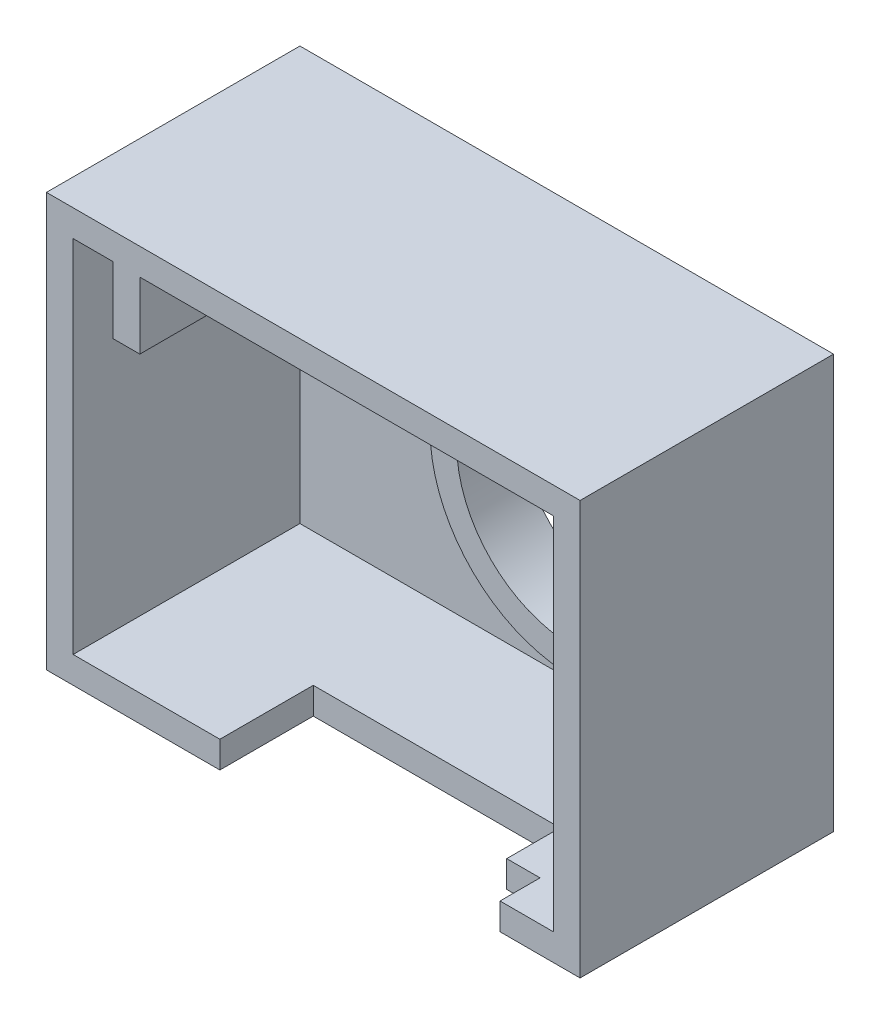
ISO-10303-21;
HEADER;
FILE_DESCRIPTION(('STEP AP214'),'2;1');
FILE_NAME('part.step','',(''),(''),'','','');
FILE_SCHEMA(('AUTOMOTIVE_DESIGN { 1 0 10303 214 1 1 1 1 }'));
ENDSEC;
DATA;
#1=APPLICATION_CONTEXT('core data for automotive mechanical design processes');
#2=APPLICATION_PROTOCOL_DEFINITION('international standard','automotive_design',2000,#1);
#3=PRODUCT_CONTEXT('',#1,'mechanical');
#4=PRODUCT('Part','Part','',(#3));
#5=PRODUCT_RELATED_PRODUCT_CATEGORY('part','',(#4));
#6=PRODUCT_DEFINITION_FORMATION('','',#4);
#7=PRODUCT_DEFINITION_CONTEXT('part definition',#1,'design');
#8=PRODUCT_DEFINITION('design','',#6,#7);
#9=PRODUCT_DEFINITION_SHAPE('','',#8);
#10=(LENGTH_UNIT() NAMED_UNIT(*) SI_UNIT(.MILLI.,.METRE.));
#11=(NAMED_UNIT(*) PLANE_ANGLE_UNIT() SI_UNIT($,.RADIAN.));
#12=(NAMED_UNIT(*) SI_UNIT($,.STERADIAN.) SOLID_ANGLE_UNIT());
#13=UNCERTAINTY_MEASURE_WITH_UNIT(LENGTH_MEASURE(1.E-05),#10,'distance_accuracy_value','');
#14=(GEOMETRIC_REPRESENTATION_CONTEXT(3) GLOBAL_UNCERTAINTY_ASSIGNED_CONTEXT((#13)) GLOBAL_UNIT_ASSIGNED_CONTEXT((#10,
#11,#12)) REPRESENTATION_CONTEXT('',''));
#15=CARTESIAN_POINT('',(0.,0.,0.));
#16=DIRECTION('',(0.,0.,1.));
#17=DIRECTION('',(1.,0.,0.));
#18=AXIS2_PLACEMENT_3D('',#15,#16,#17);
#19=CARTESIAN_POINT('',(-25.,13.5,-19.));
#20=DIRECTION('',(0.,1.,0.));
#21=DIRECTION('',(-1.,0.,0.));
#22=AXIS2_PLACEMENT_3D('',#19,#20,#21);
#23=PLANE('',#22);
#24=DIRECTION('',(0.,0.,-1.));
#25=VECTOR('',#24,1.);
#26=CARTESIAN_POINT('',(-11.,13.5,-14.));
#27=LINE('',#26,#25);
#28=CARTESIAN_POINT('',(-11.,13.5,-14.));
#29=VERTEX_POINT('',#28);
#30=CARTESIAN_POINT('',(-11.,13.5,-17.));
#31=VERTEX_POINT('',#30);
#32=EDGE_CURVE('E248',#29,#31,#27,.T.);
#33=ORIENTED_EDGE('',*,*,#32,.T.);
#34=DIRECTION('',(-1.,0.,0.));
#35=VECTOR('',#34,1.);
#36=CARTESIAN_POINT('',(-25.,13.5,-17.));
#37=LINE('',#36,#35);
#38=CARTESIAN_POINT('',(13.,13.5,-17.));
#39=VERTEX_POINT('',#38);
#40=EDGE_CURVE('E311',#39,#31,#37,.T.);
#41=ORIENTED_EDGE('',*,*,#40,.F.);
#42=DIRECTION('',(0.,0.,1.));
#43=VECTOR('',#42,1.);
#44=CARTESIAN_POINT('',(13.,13.5,-19.));
#45=LINE('',#44,#43);
#46=CARTESIAN_POINT('',(13.,13.5,0.));
#47=VERTEX_POINT('',#46);
#48=EDGE_CURVE('E302',#39,#47,#45,.T.);
#49=ORIENTED_EDGE('',*,*,#48,.T.);
#50=DIRECTION('',(-1.,0.,0.));
#51=VECTOR('',#50,1.);
#52=CARTESIAN_POINT('',(-25.,13.5,0.));
#53=LINE('',#52,#51);
#54=CARTESIAN_POINT('',(-18.,13.5,0.));
#55=VERTEX_POINT('',#54);
#56=EDGE_CURVE('E307',#47,#55,#53,.T.);
#57=ORIENTED_EDGE('',*,*,#56,.T.);
#58=DIRECTION('',(0.,0.,-1.));
#59=VECTOR('',#58,1.);
#60=CARTESIAN_POINT('',(-18.,13.5,5.3851648071345));
#61=LINE('',#60,#59);
#62=CARTESIAN_POINT('',(-18.,13.5,-14.));
#63=VERTEX_POINT('',#62);
#64=EDGE_CURVE('E284',#55,#63,#61,.T.);
#65=ORIENTED_EDGE('',*,*,#64,.T.);
#66=DIRECTION('',(-1.,0.,0.));
#67=VECTOR('',#66,1.);
#68=CARTESIAN_POINT('',(-18.,13.5,-14.));
#69=LINE('',#68,#67);
#70=EDGE_CURVE('E65',#29,#63,#69,.T.);
#71=ORIENTED_EDGE('',*,*,#70,.F.);
#72=EDGE_LOOP('',(#33,#41,#49,#57,#65,#71));
#73=FACE_BOUND('',#72,.T.);
#74=ADVANCED_FACE('F40',(#73),#23,.F.);
#75=CARTESIAN_POINT('',(0.,0.,-17.));
#76=DIRECTION('',(0.,0.,-1.));
#77=DIRECTION('',(-1.,0.,0.));
#78=AXIS2_PLACEMENT_3D('',#75,#76,#77);
#79=PLANE('',#78);
#80=CARTESIAN_POINT('',(0.,0.,-17.));
#81=DIRECTION('',(0.,0.,-1.));
#82=DIRECTION('',(-1.,0.,0.));
#83=AXIS2_PLACEMENT_3D('',#80,#81,#82);
#84=CIRCLE('',#83,10.75);
#85=CARTESIAN_POINT('',(-10.75,0.,-17.));
#86=VERTEX_POINT('',#85);
#87=EDGE_CURVE('E297',#86,#86,#84,.F.);
#88=ORIENTED_EDGE('',*,*,#87,.F.);
#89=EDGE_LOOP('',(#88));
#90=FACE_BOUND('',#89,.T.);
#91=DIRECTION('',(0.,-1.,0.));
#92=VECTOR('',#91,1.);
#93=CARTESIAN_POINT('',(-18.,6.5,-17.));
#94=LINE('',#93,#92);
#95=CARTESIAN_POINT('',(-18.,8.5,-17.));
#96=VERTEX_POINT('',#95);
#97=CARTESIAN_POINT('',(-18.,6.5,-17.));
#98=VERTEX_POINT('',#97);
#99=EDGE_CURVE('E249',#96,#98,#94,.T.);
#100=ORIENTED_EDGE('',*,*,#99,.F.);
#101=DIRECTION('',(1.,0.,0.));
#102=VECTOR('',#101,1.);
#103=CARTESIAN_POINT('',(-20.,8.5,-17.));
#104=LINE('',#103,#102);
#105=CARTESIAN_POINT('',(-20.,8.5,-17.));
#106=VERTEX_POINT('',#105);
#107=EDGE_CURVE('E279',#106,#96,#104,.T.);
#108=ORIENTED_EDGE('',*,*,#107,.F.);
#109=DIRECTION('',(0.,-1.,0.));
#110=VECTOR('',#109,1.);
#111=CARTESIAN_POINT('',(-20.,13.5,-17.));
#112=LINE('',#111,#110);
#113=CARTESIAN_POINT('',(-20.,13.5,-17.));
#114=VERTEX_POINT('',#113);
#115=EDGE_CURVE('E265',#114,#106,#112,.T.);
#116=ORIENTED_EDGE('',*,*,#115,.F.);
#117=CARTESIAN_POINT('',(-23.,13.5,-17.));
#118=VERTEX_POINT('',#117);
#119=EDGE_CURVE('E316',#114,#118,#37,.T.);
#120=ORIENTED_EDGE('',*,*,#119,.T.);
#121=DIRECTION('',(0.,-1.,0.));
#122=VECTOR('',#121,1.);
#123=CARTESIAN_POINT('',(-23.,-15.5,-17.));
#124=LINE('',#123,#122);
#125=CARTESIAN_POINT('',(-23.,-13.5,-17.));
#126=VERTEX_POINT('',#125);
#127=EDGE_CURVE('E303',#118,#126,#124,.T.);
#128=ORIENTED_EDGE('',*,*,#127,.T.);
#129=DIRECTION('',(1.,0.,0.));
#130=VECTOR('',#129,1.);
#131=CARTESIAN_POINT('',(-25.,-13.5,-17.));
#132=LINE('',#131,#130);
#133=CARTESIAN_POINT('',(13.,-13.5,-17.));
#134=VERTEX_POINT('',#133);
#135=EDGE_CURVE('E306',#126,#134,#132,.T.);
#136=ORIENTED_EDGE('',*,*,#135,.T.);
#137=DIRECTION('',(0.,1.,0.));
#138=VECTOR('',#137,1.);
#139=CARTESIAN_POINT('',(13.,-15.5,-17.));
#140=LINE('',#139,#138);
#141=EDGE_CURVE('E319',#134,#39,#140,.T.);
#142=ORIENTED_EDGE('',*,*,#141,.T.);
#143=ORIENTED_EDGE('',*,*,#40,.T.);
#144=DIRECTION('',(0.,1.,0.));
#145=VECTOR('',#144,1.);
#146=CARTESIAN_POINT('',(-11.,6.5,-17.));
#147=LINE('',#146,#145);
#148=CARTESIAN_POINT('',(-11.,6.5,-17.));
#149=VERTEX_POINT('',#148);
#150=EDGE_CURVE('E255',#149,#31,#147,.T.);
#151=ORIENTED_EDGE('',*,*,#150,.F.);
#152=DIRECTION('',(1.,0.,0.));
#153=VECTOR('',#152,1.);
#154=CARTESIAN_POINT('',(-18.,6.5,-17.));
#155=LINE('',#154,#153);
#156=EDGE_CURVE('E252',#98,#149,#155,.T.);
#157=ORIENTED_EDGE('',*,*,#156,.F.);
#158=EDGE_LOOP('',(#100,#108,#116,#120,#128,#136,#142,#143,#151,#157));
#159=FACE_BOUND('',#158,.T.);
#160=ADVANCED_FACE('F393',(#90,#159),#79,.F.);
#161=CARTESIAN_POINT('',(-18.,13.5,5.3851648071345));
#162=DIRECTION('',(-1.,0.,0.));
#163=DIRECTION('',(0.,0.,1.));
#164=AXIS2_PLACEMENT_3D('',#161,#162,#163);
#165=PLANE('',#164);
#166=DIRECTION('',(0.,-1.,0.));
#167=VECTOR('',#166,1.);
#168=CARTESIAN_POINT('',(-18.,6.5,-14.));
#169=LINE('',#168,#167);
#170=CARTESIAN_POINT('',(-18.,8.5,-14.));
#171=VERTEX_POINT('',#170);
#172=EDGE_CURVE('E239',#63,#171,#169,.T.);
#173=ORIENTED_EDGE('',*,*,#172,.F.);
#174=ORIENTED_EDGE('',*,*,#64,.F.);
#175=DIRECTION('',(0.,-1.,0.));
#176=VECTOR('',#175,1.);
#177=CARTESIAN_POINT('',(-18.,13.5,0.));
#178=LINE('',#177,#176);
#179=CARTESIAN_POINT('',(-18.,8.5,0.));
#180=VERTEX_POINT('',#179);
#181=EDGE_CURVE('E266',#55,#180,#178,.T.);
#182=ORIENTED_EDGE('',*,*,#181,.T.);
#183=DIRECTION('',(0.,0.,-1.));
#184=VECTOR('',#183,1.);
#185=CARTESIAN_POINT('',(-18.,8.5,5.3851648071345));
#186=LINE('',#185,#184);
#187=EDGE_CURVE('E287',#180,#171,#186,.T.);
#188=ORIENTED_EDGE('',*,*,#187,.T.);
#189=EDGE_LOOP('',(#173,#174,#182,#188));
#190=FACE_BOUND('',#189,.T.);
#191=ADVANCED_FACE('F399',(#190),#165,.F.);
#192=DIRECTION('',(0.,0.,-1.));
#193=VECTOR('',#192,1.);
#194=CARTESIAN_POINT('',(-20.,13.5,5.3851648071345));
#195=LINE('',#194,#193);
#196=CARTESIAN_POINT('',(-20.,13.5,0.));
#197=VERTEX_POINT('',#196);
#198=EDGE_CURVE('E281',#197,#114,#195,.T.);
#199=ORIENTED_EDGE('',*,*,#198,.F.);
#200=CARTESIAN_POINT('',(-23.,13.5,0.));
#201=VERTEX_POINT('',#200);
#202=EDGE_CURVE('E335',#197,#201,#53,.T.);
#203=ORIENTED_EDGE('',*,*,#202,.T.);
#204=DIRECTION('',(0.,0.,1.));
#205=VECTOR('',#204,1.);
#206=CARTESIAN_POINT('',(-23.,13.5,-19.));
#207=LINE('',#206,#205);
#208=EDGE_CURVE('E298',#118,#201,#207,.T.);
#209=ORIENTED_EDGE('',*,*,#208,.F.);
#210=ORIENTED_EDGE('',*,*,#119,.F.);
#211=EDGE_LOOP('',(#199,#203,#209,#210));
#212=FACE_BOUND('',#211,.T.);
#213=ADVANCED_FACE('F395',(#212),#23,.F.);
#214=CARTESIAN_POINT('',(0.,0.,0.));
#215=DIRECTION('',(0.,0.,-1.));
#216=DIRECTION('',(-1.,0.,0.));
#217=AXIS2_PLACEMENT_3D('',#214,#215,#216);
#218=PLANE('',#217);
#219=DIRECTION('',(1.,0.,0.));
#220=VECTOR('',#219,1.);
#221=CARTESIAN_POINT('',(-25.,-13.5,0.));
#222=LINE('',#221,#220);
#223=CARTESIAN_POINT('',(9.,-13.5,0.));
#224=VERTEX_POINT('',#223);
#225=CARTESIAN_POINT('',(13.,-13.5,0.));
#226=VERTEX_POINT('',#225);
#227=EDGE_CURVE('E329',#224,#226,#222,.T.);
#228=ORIENTED_EDGE('',*,*,#227,.F.);
#229=DIRECTION('',(0.,-1.,0.));
#230=VECTOR('',#229,1.);
#231=CARTESIAN_POINT('',(9.,15.501,0.));
#232=LINE('',#231,#230);
#233=CARTESIAN_POINT('',(9.,-15.5,0.));
#234=VERTEX_POINT('',#233);
#235=EDGE_CURVE('E221',#224,#234,#232,.T.);
#236=ORIENTED_EDGE('',*,*,#235,.T.);
#237=DIRECTION('',(1.,0.,0.));
#238=VECTOR('',#237,1.);
#239=CARTESIAN_POINT('',(-25.,-15.5,0.));
#240=LINE('',#239,#238);
#241=CARTESIAN_POINT('',(15.,-15.5,0.));
#242=VERTEX_POINT('',#241);
#243=EDGE_CURVE('E356',#234,#242,#240,.T.);
#244=ORIENTED_EDGE('',*,*,#243,.T.);
#245=DIRECTION('',(0.,1.,0.));
#246=VECTOR('',#245,1.);
#247=CARTESIAN_POINT('',(15.,-15.5,0.));
#248=LINE('',#247,#246);
#249=CARTESIAN_POINT('',(15.,15.5,0.));
#250=VERTEX_POINT('',#249);
#251=EDGE_CURVE('E359',#242,#250,#248,.T.);
#252=ORIENTED_EDGE('',*,*,#251,.T.);
#253=DIRECTION('',(-1.,0.,0.));
#254=VECTOR('',#253,1.);
#255=CARTESIAN_POINT('',(-25.,15.5,0.));
#256=LINE('',#255,#254);
#257=CARTESIAN_POINT('',(-25.,15.5,0.));
#258=VERTEX_POINT('',#257);
#259=EDGE_CURVE('E344',#250,#258,#256,.T.);
#260=ORIENTED_EDGE('',*,*,#259,.T.);
#261=DIRECTION('',(0.,-1.,0.));
#262=VECTOR('',#261,1.);
#263=CARTESIAN_POINT('',(-25.,-15.5,0.));
#264=LINE('',#263,#262);
#265=CARTESIAN_POINT('',(-25.,-15.5,0.));
#266=VERTEX_POINT('',#265);
#267=EDGE_CURVE('E339',#258,#266,#264,.T.);
#268=ORIENTED_EDGE('',*,*,#267,.T.);
#269=CARTESIAN_POINT('',(-12.,-15.5,0.));
#270=VERTEX_POINT('',#269);
#271=EDGE_CURVE('E357',#266,#270,#240,.T.);
#272=ORIENTED_EDGE('',*,*,#271,.T.);
#273=DIRECTION('',(0.,-1.,0.));
#274=VECTOR('',#273,1.);
#275=CARTESIAN_POINT('',(-12.,15.501,0.));
#276=LINE('',#275,#274);
#277=CARTESIAN_POINT('',(-12.,-13.5,0.));
#278=VERTEX_POINT('',#277);
#279=EDGE_CURVE('E201',#278,#270,#276,.T.);
#280=ORIENTED_EDGE('',*,*,#279,.F.);
#281=CARTESIAN_POINT('',(-23.,-13.5,0.));
#282=VERTEX_POINT('',#281);
#283=EDGE_CURVE('E330',#282,#278,#222,.T.);
#284=ORIENTED_EDGE('',*,*,#283,.F.);
#285=DIRECTION('',(0.,-1.,0.));
#286=VECTOR('',#285,1.);
#287=CARTESIAN_POINT('',(-23.,-15.5,0.));
#288=LINE('',#287,#286);
#289=EDGE_CURVE('E326',#201,#282,#288,.T.);
#290=ORIENTED_EDGE('',*,*,#289,.F.);
#291=ORIENTED_EDGE('',*,*,#202,.F.);
#292=DIRECTION('',(0.,1.,0.));
#293=VECTOR('',#292,1.);
#294=CARTESIAN_POINT('',(-20.,13.5,0.));
#295=LINE('',#294,#293);
#296=CARTESIAN_POINT('',(-20.,8.5,0.));
#297=VERTEX_POINT('',#296);
#298=EDGE_CURVE('E273',#297,#197,#295,.T.);
#299=ORIENTED_EDGE('',*,*,#298,.F.);
#300=DIRECTION('',(-1.,0.,0.));
#301=VECTOR('',#300,1.);
#302=CARTESIAN_POINT('',(-20.,8.5,0.));
#303=LINE('',#302,#301);
#304=EDGE_CURVE('E269',#180,#297,#303,.T.);
#305=ORIENTED_EDGE('',*,*,#304,.F.);
#306=ORIENTED_EDGE('',*,*,#181,.F.);
#307=ORIENTED_EDGE('',*,*,#56,.F.);
#308=DIRECTION('',(0.,1.,0.));
#309=VECTOR('',#308,1.);
#310=CARTESIAN_POINT('',(13.,-15.5,0.));
#311=LINE('',#310,#309);
#312=EDGE_CURVE('E333',#226,#47,#311,.T.);
#313=ORIENTED_EDGE('',*,*,#312,.F.);
#314=EDGE_LOOP('',(#228,#236,#244,#252,#260,#268,#272,#280,#284,#290,#291,#299,#305,#306,#307,#313));
#315=FACE_BOUND('',#314,.T.);
#316=ADVANCED_FACE('F373',(#315),#218,.F.);
#317=CARTESIAN_POINT('',(-25.,-15.5,-19.));
#318=DIRECTION('',(-1.,0.,0.));
#319=DIRECTION('',(0.,0.,1.));
#320=AXIS2_PLACEMENT_3D('',#317,#318,#319);
#321=PLANE('',#320);
#322=ORIENTED_EDGE('',*,*,#267,.F.);
#323=DIRECTION('',(0.,0.,1.));
#324=VECTOR('',#323,1.);
#325=CARTESIAN_POINT('',(-25.,15.5,-19.));
#326=LINE('',#325,#324);
#327=CARTESIAN_POINT('',(-25.,15.5,-19.));
#328=VERTEX_POINT('',#327);
#329=EDGE_CURVE('E13',#328,#258,#326,.T.);
#330=ORIENTED_EDGE('',*,*,#329,.F.);
#331=DIRECTION('',(0.,-1.,0.));
#332=VECTOR('',#331,1.);
#333=CARTESIAN_POINT('',(-25.,-15.5,-19.));
#334=LINE('',#333,#332);
#335=CARTESIAN_POINT('',(-25.,-15.5,-19.));
#336=VERTEX_POINT('',#335);
#337=EDGE_CURVE('E340',#328,#336,#334,.T.);
#338=ORIENTED_EDGE('',*,*,#337,.T.);
#339=DIRECTION('',(0.,0.,1.));
#340=VECTOR('',#339,1.);
#341=CARTESIAN_POINT('',(-25.,-15.5,-19.));
#342=LINE('',#341,#340);
#343=EDGE_CURVE('E353',#336,#266,#342,.T.);
#344=ORIENTED_EDGE('',*,*,#343,.T.);
#345=EDGE_LOOP('',(#322,#330,#338,#344));
#346=FACE_BOUND('',#345,.T.);
#347=ADVANCED_FACE('F42',(#346),#321,.T.);
#348=CARTESIAN_POINT('',(-25.,15.5,-19.));
#349=DIRECTION('',(0.,1.,0.));
#350=DIRECTION('',(-1.,0.,0.));
#351=AXIS2_PLACEMENT_3D('',#348,#349,#350);
#352=PLANE('',#351);
#353=ORIENTED_EDGE('',*,*,#259,.F.);
#354=DIRECTION('',(0.,0.,1.));
#355=VECTOR('',#354,1.);
#356=CARTESIAN_POINT('',(15.,15.5,-19.));
#357=LINE('',#356,#355);
#358=CARTESIAN_POINT('',(15.,15.5,-19.));
#359=VERTEX_POINT('',#358);
#360=EDGE_CURVE('E49',#359,#250,#357,.T.);
#361=ORIENTED_EDGE('',*,*,#360,.F.);
#362=DIRECTION('',(-1.,0.,0.));
#363=VECTOR('',#362,1.);
#364=CARTESIAN_POINT('',(-25.,15.5,-19.));
#365=LINE('',#364,#363);
#366=EDGE_CURVE('E350',#359,#328,#365,.T.);
#367=ORIENTED_EDGE('',*,*,#366,.T.);
#368=ORIENTED_EDGE('',*,*,#329,.T.);
#369=EDGE_LOOP('',(#353,#361,#367,#368));
#370=FACE_BOUND('',#369,.T.);
#371=ADVANCED_FACE('F377',(#370),#352,.T.);
#372=CARTESIAN_POINT('',(15.,-15.5,-19.));
#373=DIRECTION('',(1.,0.,0.));
#374=DIRECTION('',(0.,0.,-1.));
#375=AXIS2_PLACEMENT_3D('',#372,#373,#374);
#376=PLANE('',#375);
#377=ORIENTED_EDGE('',*,*,#251,.F.);
#378=DIRECTION('',(0.,0.,1.));
#379=VECTOR('',#378,1.);
#380=CARTESIAN_POINT('',(15.,-15.5,-19.));
#381=LINE('',#380,#379);
#382=CARTESIAN_POINT('',(15.,-15.5,-19.));
#383=VERTEX_POINT('',#382);
#384=EDGE_CURVE('E365',#383,#242,#381,.T.);
#385=ORIENTED_EDGE('',*,*,#384,.F.);
#386=DIRECTION('',(0.,1.,0.));
#387=VECTOR('',#386,1.);
#388=CARTESIAN_POINT('',(15.,-15.5,-19.));
#389=LINE('',#388,#387);
#390=EDGE_CURVE('E347',#383,#359,#389,.T.);
#391=ORIENTED_EDGE('',*,*,#390,.T.);
#392=ORIENTED_EDGE('',*,*,#360,.T.);
#393=EDGE_LOOP('',(#377,#385,#391,#392));
#394=FACE_BOUND('',#393,.T.);
#395=ADVANCED_FACE('F384',(#394),#376,.T.);
#396=CARTESIAN_POINT('',(-25.,-15.5,-19.));
#397=DIRECTION('',(0.,-1.,0.));
#398=DIRECTION('',(0.,0.,-1.));
#399=AXIS2_PLACEMENT_3D('',#396,#397,#398);
#400=PLANE('',#399);
#401=DIRECTION('',(0.,0.,1.));
#402=VECTOR('',#401,1.);
#403=CARTESIAN_POINT('',(9.,-15.5,-3.));
#404=LINE('',#403,#402);
#405=CARTESIAN_POINT('',(9.,-15.5,-3.));
#406=VERTEX_POINT('',#405);
#407=EDGE_CURVE('E195',#406,#234,#404,.T.);
#408=ORIENTED_EDGE('',*,*,#407,.F.);
#409=DIRECTION('',(1.,0.,0.));
#410=VECTOR('',#409,1.);
#411=CARTESIAN_POINT('',(6.5,-15.5,-3.));
#412=LINE('',#411,#410);
#413=CARTESIAN_POINT('',(6.5,-15.5,-3.));
#414=VERTEX_POINT('',#413);
#415=EDGE_CURVE('E213',#414,#406,#412,.T.);
#416=ORIENTED_EDGE('',*,*,#415,.F.);
#417=DIRECTION('',(0.,0.,1.));
#418=VECTOR('',#417,1.);
#419=CARTESIAN_POINT('',(6.5,-15.5,-3.));
#420=LINE('',#419,#418);
#421=CARTESIAN_POINT('',(6.5,-15.5,-7.));
#422=VERTEX_POINT('',#421);
#423=EDGE_CURVE('E211',#422,#414,#420,.T.);
#424=ORIENTED_EDGE('',*,*,#423,.F.);
#425=DIRECTION('',(1.,0.,0.));
#426=VECTOR('',#425,1.);
#427=CARTESIAN_POINT('',(-12.,-15.5,-7.));
#428=LINE('',#427,#426);
#429=CARTESIAN_POINT('',(-12.,-15.5,-7.));
#430=VERTEX_POINT('',#429);
#431=EDGE_CURVE('E190',#430,#422,#428,.T.);
#432=ORIENTED_EDGE('',*,*,#431,.F.);
#433=DIRECTION('',(0.,0.,-1.));
#434=VECTOR('',#433,1.);
#435=CARTESIAN_POINT('',(-12.,-15.5,0.));
#436=LINE('',#435,#434);
#437=EDGE_CURVE('E198',#270,#430,#436,.T.);
#438=ORIENTED_EDGE('',*,*,#437,.F.);
#439=ORIENTED_EDGE('',*,*,#271,.F.);
#440=ORIENTED_EDGE('',*,*,#343,.F.);
#441=DIRECTION('',(1.,0.,0.));
#442=VECTOR('',#441,1.);
#443=CARTESIAN_POINT('',(-25.,-15.5,-19.));
#444=LINE('',#443,#442);
#445=EDGE_CURVE('E343',#336,#383,#444,.T.);
#446=ORIENTED_EDGE('',*,*,#445,.T.);
#447=ORIENTED_EDGE('',*,*,#384,.T.);
#448=ORIENTED_EDGE('',*,*,#243,.F.);
#449=EDGE_LOOP('',(#408,#416,#424,#432,#438,#439,#440,#446,#447,#448));
#450=FACE_BOUND('',#449,.T.);
#451=ADVANCED_FACE('F208',(#450),#400,.T.);
#452=CARTESIAN_POINT('',(0.,0.,-19.));
#453=DIRECTION('',(0.,0.,-1.));
#454=DIRECTION('',(-1.,0.,0.));
#455=AXIS2_PLACEMENT_3D('',#452,#453,#454);
#456=PLANE('',#455);
#457=CARTESIAN_POINT('',(-15.,10.5,-19.));
#458=DIRECTION('',(0.,0.,-1.));
#459=DIRECTION('',(-1.,0.,0.));
#460=AXIS2_PLACEMENT_3D('',#457,#458,#459);
#461=CIRCLE('',#460,3.25);
#462=CARTESIAN_POINT('',(-18.25,10.5,-19.));
#463=VERTEX_POINT('',#462);
#464=EDGE_CURVE('E230',#463,#463,#461,.T.);
#465=ORIENTED_EDGE('',*,*,#464,.F.);
#466=EDGE_LOOP('',(#465));
#467=FACE_BOUND('',#466,.T.);
#468=CARTESIAN_POINT('',(0.,0.,-19.));
#469=DIRECTION('',(0.,0.,1.));
#470=DIRECTION('',(1.,0.,0.));
#471=AXIS2_PLACEMENT_3D('',#468,#469,#470);
#472=CIRCLE('',#471,8.75);
#473=CARTESIAN_POINT('',(8.75,0.,-19.));
#474=VERTEX_POINT('',#473);
#475=EDGE_CURVE('E301',#474,#474,#472,.T.);
#476=ORIENTED_EDGE('',*,*,#475,.T.);
#477=EDGE_LOOP('',(#476));
#478=FACE_BOUND('',#477,.T.);
#479=ORIENTED_EDGE('',*,*,#337,.F.);
#480=ORIENTED_EDGE('',*,*,#366,.F.);
#481=ORIENTED_EDGE('',*,*,#390,.F.);
#482=ORIENTED_EDGE('',*,*,#445,.F.);
#483=EDGE_LOOP('',(#479,#480,#481,#482));
#484=FACE_BOUND('',#483,.T.);
#485=ADVANCED_FACE('F380',(#467,#478,#484),#456,.T.);
#486=CARTESIAN_POINT('',(0.,0.,-19.));
#487=DIRECTION('',(0.,0.,1.));
#488=DIRECTION('',(1.,0.,0.));
#489=AXIS2_PLACEMENT_3D('',#486,#487,#488);
#490=CYLINDRICAL_SURFACE('',#489,8.75);
#491=CARTESIAN_POINT('',(0.,0.,-14.5));
#492=DIRECTION('',(0.,0.,-1.));
#493=DIRECTION('',(-1.,0.,0.));
#494=AXIS2_PLACEMENT_3D('',#491,#492,#493);
#495=CIRCLE('',#494,8.75);
#496=CARTESIAN_POINT('',(-8.75,0.,-14.5));
#497=VERTEX_POINT('',#496);
#498=EDGE_CURVE('E294',#497,#497,#495,.F.);
#499=ORIENTED_EDGE('',*,*,#498,.T.);
#500=EDGE_LOOP('',(#499));
#501=FACE_BOUND('',#500,.T.);
#502=ORIENTED_EDGE('',*,*,#475,.F.);
#503=EDGE_LOOP('',(#502));
#504=FACE_BOUND('',#503,.T.);
#505=ADVANCED_FACE('F489',(#501,#504),#490,.F.);
#506=CARTESIAN_POINT('',(-23.,-15.5,-19.));
#507=DIRECTION('',(-1.,0.,0.));
#508=DIRECTION('',(0.,0.,1.));
#509=AXIS2_PLACEMENT_3D('',#506,#507,#508);
#510=PLANE('',#509);
#511=ORIENTED_EDGE('',*,*,#289,.T.);
#512=DIRECTION('',(0.,0.,1.));
#513=VECTOR('',#512,1.);
#514=CARTESIAN_POINT('',(-23.,-13.5,-19.));
#515=LINE('',#514,#513);
#516=EDGE_CURVE('E308',#126,#282,#515,.T.);
#517=ORIENTED_EDGE('',*,*,#516,.F.);
#518=ORIENTED_EDGE('',*,*,#127,.F.);
#519=ORIENTED_EDGE('',*,*,#208,.T.);
#520=EDGE_LOOP('',(#511,#517,#518,#519));
#521=FACE_BOUND('',#520,.T.);
#522=ADVANCED_FACE('F462',(#521),#510,.F.);
#523=CARTESIAN_POINT('',(13.,-15.5,-19.));
#524=DIRECTION('',(1.,0.,0.));
#525=DIRECTION('',(0.,0.,-1.));
#526=AXIS2_PLACEMENT_3D('',#523,#524,#525);
#527=PLANE('',#526);
#528=ORIENTED_EDGE('',*,*,#312,.T.);
#529=ORIENTED_EDGE('',*,*,#48,.F.);
#530=ORIENTED_EDGE('',*,*,#141,.F.);
#531=DIRECTION('',(0.,0.,1.));
#532=VECTOR('',#531,1.);
#533=CARTESIAN_POINT('',(13.,-13.5,-19.));
#534=LINE('',#533,#532);
#535=EDGE_CURVE('E310',#134,#226,#534,.T.);
#536=ORIENTED_EDGE('',*,*,#535,.T.);
#537=EDGE_LOOP('',(#528,#529,#530,#536));
#538=FACE_BOUND('',#537,.T.);
#539=ADVANCED_FACE('F442',(#538),#527,.F.);
#540=CARTESIAN_POINT('',(-25.,-13.5,-19.));
#541=DIRECTION('',(0.,-1.,0.));
#542=DIRECTION('',(0.,0.,-1.));
#543=AXIS2_PLACEMENT_3D('',#540,#541,#542);
#544=PLANE('',#543);
#545=DIRECTION('',(-1.,0.,0.));
#546=VECTOR('',#545,1.);
#547=CARTESIAN_POINT('',(6.5,-13.5,-3.));
#548=LINE('',#547,#546);
#549=CARTESIAN_POINT('',(9.,-13.5,-3.));
#550=VERTEX_POINT('',#549);
#551=CARTESIAN_POINT('',(6.5,-13.5,-3.));
#552=VERTEX_POINT('',#551);
#553=EDGE_CURVE('E451',#550,#552,#548,.T.);
#554=ORIENTED_EDGE('',*,*,#553,.F.);
#555=DIRECTION('',(0.,0.,-1.));
#556=VECTOR('',#555,1.);
#557=CARTESIAN_POINT('',(9.,-13.5,-3.));
#558=LINE('',#557,#556);
#559=EDGE_CURVE('E448',#224,#550,#558,.T.);
#560=ORIENTED_EDGE('',*,*,#559,.F.);
#561=ORIENTED_EDGE('',*,*,#227,.T.);
#562=ORIENTED_EDGE('',*,*,#535,.F.);
#563=ORIENTED_EDGE('',*,*,#135,.F.);
#564=ORIENTED_EDGE('',*,*,#516,.T.);
#565=ORIENTED_EDGE('',*,*,#283,.T.);
#566=DIRECTION('',(0.,0.,1.));
#567=VECTOR('',#566,1.);
#568=CARTESIAN_POINT('',(-12.,-13.5,0.));
#569=LINE('',#568,#567);
#570=CARTESIAN_POINT('',(-12.,-13.5,-7.));
#571=VERTEX_POINT('',#570);
#572=EDGE_CURVE('E205',#571,#278,#569,.T.);
#573=ORIENTED_EDGE('',*,*,#572,.F.);
#574=DIRECTION('',(-1.,0.,0.));
#575=VECTOR('',#574,1.);
#576=CARTESIAN_POINT('',(-12.,-13.5,-7.));
#577=LINE('',#576,#575);
#578=CARTESIAN_POINT('',(6.5,-13.5,-7.));
#579=VERTEX_POINT('',#578);
#580=EDGE_CURVE('E57',#579,#571,#577,.T.);
#581=ORIENTED_EDGE('',*,*,#580,.F.);
#582=DIRECTION('',(0.,0.,-1.));
#583=VECTOR('',#582,1.);
#584=CARTESIAN_POINT('',(6.5,-13.5,-3.));
#585=LINE('',#584,#583);
#586=EDGE_CURVE('E454',#552,#579,#585,.T.);
#587=ORIENTED_EDGE('',*,*,#586,.F.);
#588=EDGE_LOOP('',(#554,#560,#561,#562,#563,#564,#565,#573,#581,#587));
#589=FACE_BOUND('',#588,.T.);
#590=ADVANCED_FACE('F446',(#589),#544,.F.);
#591=CARTESIAN_POINT('',(0.,0.,-19.));
#592=DIRECTION('',(0.,0.,1.));
#593=DIRECTION('',(1.,0.,0.));
#594=AXIS2_PLACEMENT_3D('',#591,#592,#593);
#595=CYLINDRICAL_SURFACE('',#594,10.75);
#596=CARTESIAN_POINT('',(0.,0.,-14.5));
#597=DIRECTION('',(0.,0.,-1.));
#598=DIRECTION('',(-1.,0.,0.));
#599=AXIS2_PLACEMENT_3D('',#596,#597,#598);
#600=CIRCLE('',#599,10.75);
#601=CARTESIAN_POINT('',(-10.75,0.,-14.5));
#602=VERTEX_POINT('',#601);
#603=EDGE_CURVE('E276',#602,#602,#600,.F.);
#604=ORIENTED_EDGE('',*,*,#603,.F.);
#605=EDGE_LOOP('',(#604));
#606=FACE_BOUND('',#605,.T.);
#607=ORIENTED_EDGE('',*,*,#87,.T.);
#608=EDGE_LOOP('',(#607));
#609=FACE_BOUND('',#608,.T.);
#610=ADVANCED_FACE('F486',(#606,#609),#595,.T.);
#611=CARTESIAN_POINT('',(0.,0.,-14.5));
#612=DIRECTION('',(0.,0.,-1.));
#613=DIRECTION('',(-1.,0.,0.));
#614=AXIS2_PLACEMENT_3D('',#611,#612,#613);
#615=PLANE('',#614);
#616=ORIENTED_EDGE('',*,*,#603,.T.);
#617=EDGE_LOOP('',(#616));
#618=FACE_BOUND('',#617,.T.);
#619=ORIENTED_EDGE('',*,*,#498,.F.);
#620=EDGE_LOOP('',(#619));
#621=FACE_BOUND('',#620,.T.);
#622=ADVANCED_FACE('F482',(#618,#621),#615,.F.);
#623=CARTESIAN_POINT('',(-20.,8.5,5.3851648071345));
#624=DIRECTION('',(0.,1.,0.));
#625=DIRECTION('',(0.,0.,1.));
#626=AXIS2_PLACEMENT_3D('',#623,#624,#625);
#627=PLANE('',#626);
#628=ORIENTED_EDGE('',*,*,#187,.F.);
#629=ORIENTED_EDGE('',*,*,#304,.T.);
#630=DIRECTION('',(0.,0.,-1.));
#631=VECTOR('',#630,1.);
#632=CARTESIAN_POINT('',(-20.,8.5,5.3851648071345));
#633=LINE('',#632,#631);
#634=EDGE_CURVE('E270',#297,#106,#633,.T.);
#635=ORIENTED_EDGE('',*,*,#634,.T.);
#636=ORIENTED_EDGE('',*,*,#107,.T.);
#637=EDGE_CURVE('E286',#171,#96,#186,.T.);
#638=ORIENTED_EDGE('',*,*,#637,.F.);
#639=EDGE_LOOP('',(#628,#629,#635,#636,#638));
#640=FACE_BOUND('',#639,.T.);
#641=ADVANCED_FACE('F423',(#640),#627,.F.);
#642=CARTESIAN_POINT('',(-20.,13.5,5.3851648071345));
#643=DIRECTION('',(1.,0.,0.));
#644=DIRECTION('',(0.,0.,-1.));
#645=AXIS2_PLACEMENT_3D('',#642,#643,#644);
#646=PLANE('',#645);
#647=ORIENTED_EDGE('',*,*,#634,.F.);
#648=ORIENTED_EDGE('',*,*,#298,.T.);
#649=ORIENTED_EDGE('',*,*,#198,.T.);
#650=ORIENTED_EDGE('',*,*,#115,.T.);
#651=EDGE_LOOP('',(#647,#648,#649,#650));
#652=FACE_BOUND('',#651,.T.);
#653=ADVANCED_FACE('F420',(#652),#646,.F.);
#654=CARTESIAN_POINT('',(-18.,6.5,-14.));
#655=DIRECTION('',(1.,0.,0.));
#656=DIRECTION('',(0.,0.,-1.));
#657=AXIS2_PLACEMENT_3D('',#654,#655,#656);
#658=PLANE('',#657);
#659=CARTESIAN_POINT('',(-18.,6.5,-14.));
#660=VERTEX_POINT('',#659);
#661=EDGE_CURVE('E243',#171,#660,#169,.T.);
#662=ORIENTED_EDGE('',*,*,#661,.F.);
#663=ORIENTED_EDGE('',*,*,#637,.T.);
#664=ORIENTED_EDGE('',*,*,#99,.T.);
#665=DIRECTION('',(0.,0.,-1.));
#666=VECTOR('',#665,1.);
#667=CARTESIAN_POINT('',(-18.,6.5,-14.));
#668=LINE('',#667,#666);
#669=EDGE_CURVE('E262',#660,#98,#668,.T.);
#670=ORIENTED_EDGE('',*,*,#669,.F.);
#671=EDGE_LOOP('',(#662,#663,#664,#670));
#672=FACE_BOUND('',#671,.T.);
#673=ADVANCED_FACE('F467',(#672),#658,.F.);
#674=CARTESIAN_POINT('',(-18.,6.5,-14.));
#675=DIRECTION('',(0.,1.,0.));
#676=DIRECTION('',(0.,0.,1.));
#677=AXIS2_PLACEMENT_3D('',#674,#675,#676);
#678=PLANE('',#677);
#679=ORIENTED_EDGE('',*,*,#156,.T.);
#680=DIRECTION('',(0.,0.,-1.));
#681=VECTOR('',#680,1.);
#682=CARTESIAN_POINT('',(-11.,6.5,-14.));
#683=LINE('',#682,#681);
#684=CARTESIAN_POINT('',(-11.,6.5,-14.));
#685=VERTEX_POINT('',#684);
#686=EDGE_CURVE('E259',#685,#149,#683,.T.);
#687=ORIENTED_EDGE('',*,*,#686,.F.);
#688=DIRECTION('',(1.,0.,0.));
#689=VECTOR('',#688,1.);
#690=CARTESIAN_POINT('',(-18.,6.5,-14.));
#691=LINE('',#690,#689);
#692=EDGE_CURVE('E242',#660,#685,#691,.T.);
#693=ORIENTED_EDGE('',*,*,#692,.F.);
#694=ORIENTED_EDGE('',*,*,#669,.T.);
#695=EDGE_LOOP('',(#679,#687,#693,#694));
#696=FACE_BOUND('',#695,.T.);
#697=ADVANCED_FACE('F469',(#696),#678,.F.);
#698=CARTESIAN_POINT('',(-11.,6.5,-14.));
#699=DIRECTION('',(-1.,0.,0.));
#700=DIRECTION('',(0.,0.,1.));
#701=AXIS2_PLACEMENT_3D('',#698,#699,#700);
#702=PLANE('',#701);
#703=ORIENTED_EDGE('',*,*,#150,.T.);
#704=ORIENTED_EDGE('',*,*,#32,.F.);
#705=DIRECTION('',(0.,1.,0.));
#706=VECTOR('',#705,1.);
#707=CARTESIAN_POINT('',(-11.,6.5,-14.));
#708=LINE('',#707,#706);
#709=EDGE_CURVE('E245',#685,#29,#708,.T.);
#710=ORIENTED_EDGE('',*,*,#709,.F.);
#711=ORIENTED_EDGE('',*,*,#686,.T.);
#712=EDGE_LOOP('',(#703,#704,#710,#711));
#713=FACE_BOUND('',#712,.T.);
#714=ADVANCED_FACE('F435',(#713),#702,.F.);
#715=CARTESIAN_POINT('',(0.,0.,-14.));
#716=DIRECTION('',(0.,0.,-1.));
#717=DIRECTION('',(-1.,0.,0.));
#718=AXIS2_PLACEMENT_3D('',#715,#716,#717);
#719=PLANE('',#718);
#720=CARTESIAN_POINT('',(-15.,10.5,-14.));
#721=DIRECTION('',(0.,0.,-1.));
#722=DIRECTION('',(-1.,0.,0.));
#723=AXIS2_PLACEMENT_3D('',#720,#721,#722);
#724=CIRCLE('',#723,1.7);
#725=CARTESIAN_POINT('',(-16.7,10.5,-14.));
#726=VERTEX_POINT('',#725);
#727=EDGE_CURVE('E44',#726,#726,#724,.T.);
#728=ORIENTED_EDGE('',*,*,#727,.T.);
#729=EDGE_LOOP('',(#728));
#730=FACE_BOUND('',#729,.T.);
#731=ORIENTED_EDGE('',*,*,#172,.T.);
#732=ORIENTED_EDGE('',*,*,#661,.T.);
#733=ORIENTED_EDGE('',*,*,#692,.T.);
#734=ORIENTED_EDGE('',*,*,#709,.T.);
#735=ORIENTED_EDGE('',*,*,#70,.T.);
#736=EDGE_LOOP('',(#731,#732,#733,#734,#735));
#737=FACE_BOUND('',#736,.T.);
#738=ADVANCED_FACE('F429',(#730,#737),#719,.F.);
#739=CARTESIAN_POINT('',(-15.,10.5,-19.));
#740=DIRECTION('',(0.,0.,-1.));
#741=DIRECTION('',(-1.,0.,0.));
#742=AXIS2_PLACEMENT_3D('',#739,#740,#741);
#743=CYLINDRICAL_SURFACE('',#742,1.7);
#744=CARTESIAN_POINT('',(-15.,10.5,-16.));
#745=DIRECTION('',(0.,0.,-1.));
#746=DIRECTION('',(-1.,0.,0.));
#747=AXIS2_PLACEMENT_3D('',#744,#745,#746);
#748=CIRCLE('',#747,1.7);
#749=CARTESIAN_POINT('',(-16.7,10.5,-16.));
#750=VERTEX_POINT('',#749);
#751=EDGE_CURVE('E236',#750,#750,#748,.T.);
#752=ORIENTED_EDGE('',*,*,#751,.T.);
#753=EDGE_LOOP('',(#752));
#754=FACE_BOUND('',#753,.T.);
#755=ORIENTED_EDGE('',*,*,#727,.F.);
#756=EDGE_LOOP('',(#755));
#757=FACE_BOUND('',#756,.T.);
#758=ADVANCED_FACE('F562',(#754,#757),#743,.F.);
#759=CARTESIAN_POINT('',(-13.3,10.5,-16.));
#760=DIRECTION('',(0.,0.,1.));
#761=DIRECTION('',(1.,0.,0.));
#762=AXIS2_PLACEMENT_3D('',#759,#760,#761);
#763=PLANE('',#762);
#764=ORIENTED_EDGE('',*,*,#751,.F.);
#765=EDGE_LOOP('',(#764));
#766=FACE_BOUND('',#765,.T.);
#767=CARTESIAN_POINT('',(-15.,10.5,-16.));
#768=DIRECTION('',(0.,0.,-1.));
#769=DIRECTION('',(-1.,0.,0.));
#770=AXIS2_PLACEMENT_3D('',#767,#768,#769);
#771=CIRCLE('',#770,3.25);
#772=CARTESIAN_POINT('',(-18.25,10.5,-16.));
#773=VERTEX_POINT('',#772);
#774=EDGE_CURVE('E233',#773,#773,#771,.T.);
#775=ORIENTED_EDGE('',*,*,#774,.T.);
#776=EDGE_LOOP('',(#775));
#777=FACE_BOUND('',#776,.T.);
#778=ADVANCED_FACE('F571',(#766,#777),#763,.F.);
#779=CARTESIAN_POINT('',(-15.,10.5,-19.));
#780=DIRECTION('',(0.,0.,-1.));
#781=DIRECTION('',(-1.,0.,0.));
#782=AXIS2_PLACEMENT_3D('',#779,#780,#781);
#783=CYLINDRICAL_SURFACE('',#782,3.25);
#784=ORIENTED_EDGE('',*,*,#774,.F.);
#785=EDGE_LOOP('',(#784));
#786=FACE_BOUND('',#785,.T.);
#787=ORIENTED_EDGE('',*,*,#464,.T.);
#788=EDGE_LOOP('',(#787));
#789=FACE_BOUND('',#788,.T.);
#790=ADVANCED_FACE('F581',(#786,#789),#783,.F.);
#791=CARTESIAN_POINT('',(-12.,15.501,-7.));
#792=DIRECTION('',(0.,0.,-1.));
#793=DIRECTION('',(-1.,0.,0.));
#794=AXIS2_PLACEMENT_3D('',#791,#792,#793);
#795=PLANE('',#794);
#796=ORIENTED_EDGE('',*,*,#580,.T.);
#797=DIRECTION('',(0.,-1.,0.));
#798=VECTOR('',#797,1.);
#799=CARTESIAN_POINT('',(-12.,15.501,-7.));
#800=LINE('',#799,#798);
#801=EDGE_CURVE('E186',#571,#430,#800,.T.);
#802=ORIENTED_EDGE('',*,*,#801,.T.);
#803=ORIENTED_EDGE('',*,*,#431,.T.);
#804=DIRECTION('',(0.,-1.,0.));
#805=VECTOR('',#804,1.);
#806=CARTESIAN_POINT('',(6.5,15.501,-7.));
#807=LINE('',#806,#805);
#808=EDGE_CURVE('E194',#579,#422,#807,.T.);
#809=ORIENTED_EDGE('',*,*,#808,.F.);
#810=EDGE_LOOP('',(#796,#802,#803,#809));
#811=FACE_BOUND('',#810,.T.);
#812=ADVANCED_FACE('F188',(#811),#795,.F.);
#813=CARTESIAN_POINT('',(6.5,15.501,-3.));
#814=DIRECTION('',(1.,0.,0.));
#815=DIRECTION('',(0.,0.,-1.));
#816=AXIS2_PLACEMENT_3D('',#813,#814,#815);
#817=PLANE('',#816);
#818=ORIENTED_EDGE('',*,*,#586,.T.);
#819=ORIENTED_EDGE('',*,*,#808,.T.);
#820=ORIENTED_EDGE('',*,*,#423,.T.);
#821=DIRECTION('',(0.,-1.,0.));
#822=VECTOR('',#821,1.);
#823=CARTESIAN_POINT('',(6.5,15.501,-3.));
#824=LINE('',#823,#822);
#825=EDGE_CURVE('E226',#552,#414,#824,.T.);
#826=ORIENTED_EDGE('',*,*,#825,.F.);
#827=EDGE_LOOP('',(#818,#819,#820,#826));
#828=FACE_BOUND('',#827,.T.);
#829=ADVANCED_FACE('F459',(#828),#817,.F.);
#830=CARTESIAN_POINT('',(6.5,15.501,-3.));
#831=DIRECTION('',(0.,0.,-1.));
#832=DIRECTION('',(-1.,0.,0.));
#833=AXIS2_PLACEMENT_3D('',#830,#831,#832);
#834=PLANE('',#833);
#835=ORIENTED_EDGE('',*,*,#553,.T.);
#836=ORIENTED_EDGE('',*,*,#825,.T.);
#837=ORIENTED_EDGE('',*,*,#415,.T.);
#838=DIRECTION('',(0.,-1.,0.));
#839=VECTOR('',#838,1.);
#840=CARTESIAN_POINT('',(9.,15.501,-3.));
#841=LINE('',#840,#839);
#842=EDGE_CURVE('E224',#550,#406,#841,.T.);
#843=ORIENTED_EDGE('',*,*,#842,.F.);
#844=EDGE_LOOP('',(#835,#836,#837,#843));
#845=FACE_BOUND('',#844,.T.);
#846=ADVANCED_FACE('F673',(#845),#834,.F.);
#847=CARTESIAN_POINT('',(9.,15.501,-3.));
#848=DIRECTION('',(1.,0.,0.));
#849=DIRECTION('',(0.,0.,-1.));
#850=AXIS2_PLACEMENT_3D('',#847,#848,#849);
#851=PLANE('',#850);
#852=ORIENTED_EDGE('',*,*,#559,.T.);
#853=ORIENTED_EDGE('',*,*,#842,.T.);
#854=ORIENTED_EDGE('',*,*,#407,.T.);
#855=ORIENTED_EDGE('',*,*,#235,.F.);
#856=EDGE_LOOP('',(#852,#853,#854,#855));
#857=FACE_BOUND('',#856,.T.);
#858=ADVANCED_FACE('F680',(#857),#851,.F.);
#859=CARTESIAN_POINT('',(-12.,15.501,0.));
#860=DIRECTION('',(-1.,0.,0.));
#861=DIRECTION('',(0.,0.,1.));
#862=AXIS2_PLACEMENT_3D('',#859,#860,#861);
#863=PLANE('',#862);
#864=ORIENTED_EDGE('',*,*,#572,.T.);
#865=ORIENTED_EDGE('',*,*,#279,.T.);
#866=ORIENTED_EDGE('',*,*,#437,.T.);
#867=ORIENTED_EDGE('',*,*,#801,.F.);
#868=EDGE_LOOP('',(#864,#865,#866,#867));
#869=FACE_BOUND('',#868,.T.);
#870=ADVANCED_FACE('F199',(#869),#863,.F.);
#871=CLOSED_SHELL('',(#74,#160,#191,#213,#316,#347,#371,#395,#451,#485,#505,#522,#539,#590,#610,
#622,#641,#653,#673,#697,#714,#738,#758,#778,#790,#812,#829,#846,#858,#870));
#872=MANIFOLD_SOLID_BREP('B2',#871);
#873=ADVANCED_BREP_SHAPE_REPRESENTATION('',(#18,#872),#14);
#874=SHAPE_DEFINITION_REPRESENTATION(#9,#873);
ENDSEC;
END-ISO-10303-21;
